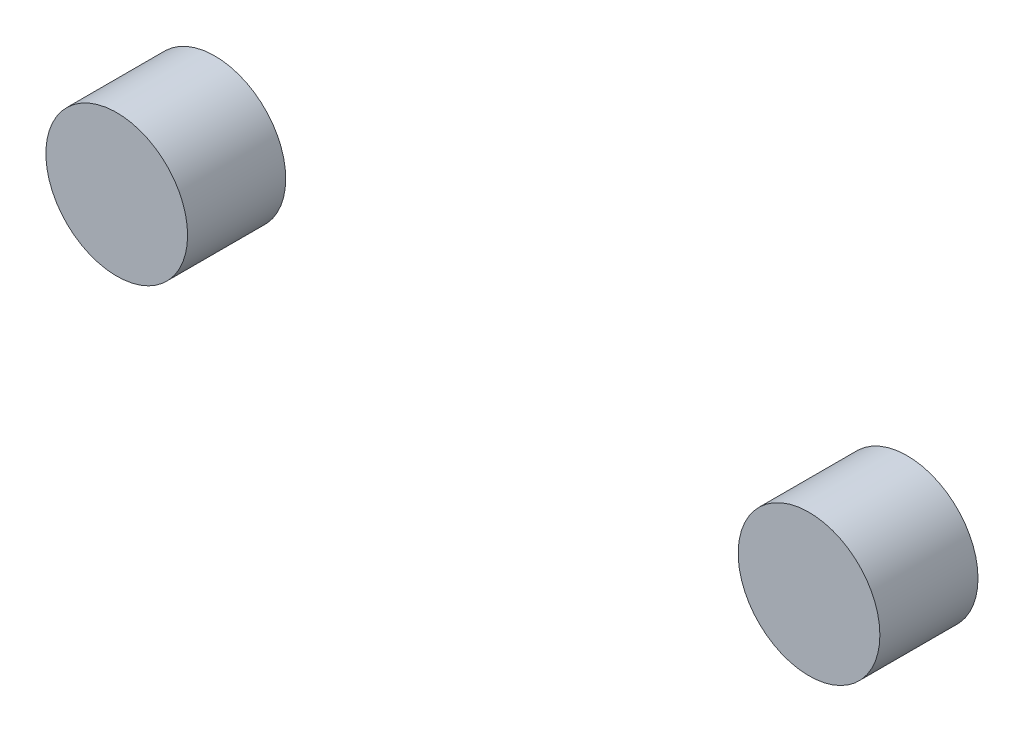
ISO-10303-21;
HEADER;
FILE_DESCRIPTION(('STEP AP214'),'2;1');
FILE_NAME('part.step','',(''),(''),'','','');
FILE_SCHEMA(('AUTOMOTIVE_DESIGN { 1 0 10303 214 1 1 1 1 }'));
ENDSEC;
DATA;
#1=APPLICATION_CONTEXT('core data for automotive mechanical design processes');
#2=APPLICATION_PROTOCOL_DEFINITION('international standard','automotive_design',2000,#1);
#3=PRODUCT_CONTEXT('',#1,'mechanical');
#4=PRODUCT('Part','Part','',(#3));
#5=PRODUCT_RELATED_PRODUCT_CATEGORY('part','',(#4));
#6=PRODUCT_DEFINITION_FORMATION('','',#4);
#7=PRODUCT_DEFINITION_CONTEXT('part definition',#1,'design');
#8=PRODUCT_DEFINITION('design','',#6,#7);
#9=PRODUCT_DEFINITION_SHAPE('','',#8);
#10=(LENGTH_UNIT() NAMED_UNIT(*) SI_UNIT(.MILLI.,.METRE.));
#11=(NAMED_UNIT(*) PLANE_ANGLE_UNIT() SI_UNIT($,.RADIAN.));
#12=(NAMED_UNIT(*) SI_UNIT($,.STERADIAN.) SOLID_ANGLE_UNIT());
#13=UNCERTAINTY_MEASURE_WITH_UNIT(LENGTH_MEASURE(1.E-05),#10,'distance_accuracy_value','');
#14=(GEOMETRIC_REPRESENTATION_CONTEXT(3) GLOBAL_UNCERTAINTY_ASSIGNED_CONTEXT((#13)) GLOBAL_UNIT_ASSIGNED_CONTEXT((#10,
#11,#12)) REPRESENTATION_CONTEXT('',''));
#15=CARTESIAN_POINT('',(0.,0.,0.));
#16=DIRECTION('',(0.,0.,1.));
#17=DIRECTION('',(1.,0.,0.));
#18=AXIS2_PLACEMENT_3D('',#15,#16,#17);
#19=CARTESIAN_POINT('',(1.275,-15.24,-1.7));
#20=DIRECTION('',(0.,0.,1.));
#21=DIRECTION('',(1.,0.,0.));
#22=AXIS2_PLACEMENT_3D('',#19,#20,#21);
#23=PLANE('',#22);
#24=CARTESIAN_POINT('',(1.275,-15.24,-1.7));
#25=DIRECTION('',(0.,0.,1.));
#26=DIRECTION('',(1.,0.,0.));
#27=AXIS2_PLACEMENT_3D('',#24,#25,#26);
#28=CIRCLE('',#27,1.3);
#29=CARTESIAN_POINT('',(2.575,-15.24,-1.7));
#30=VERTEX_POINT('',#29);
#31=EDGE_CURVE('P0_E11',#30,#30,#28,.T.);
#32=ORIENTED_EDGE('',*,*,#31,.F.);
#33=EDGE_LOOP('',(#32));
#34=FACE_BOUND('',#33,.T.);
#35=ADVANCED_FACE('P0_F16',(#34),#23,.F.);
#36=CARTESIAN_POINT('',(1.275,-15.24,0.1));
#37=DIRECTION('',(0.,0.,1.));
#38=DIRECTION('',(1.,0.,0.));
#39=AXIS2_PLACEMENT_3D('',#36,#37,#38);
#40=PLANE('',#39);
#41=CARTESIAN_POINT('',(1.275,-15.24,0.1));
#42=DIRECTION('',(0.,0.,1.));
#43=DIRECTION('',(1.,0.,0.));
#44=AXIS2_PLACEMENT_3D('',#41,#42,#43);
#45=CIRCLE('',#44,1.3);
#46=CARTESIAN_POINT('',(2.575,-15.24,0.1));
#47=VERTEX_POINT('',#46);
#48=EDGE_CURVE('P0_E20',#47,#47,#45,.T.);
#49=ORIENTED_EDGE('',*,*,#48,.T.);
#50=EDGE_LOOP('',(#49));
#51=FACE_BOUND('',#50,.T.);
#52=ADVANCED_FACE('P0_F18',(#51),#40,.T.);
#53=CARTESIAN_POINT('',(1.275,-15.24,-1.7));
#54=DIRECTION('',(0.,0.,1.));
#55=DIRECTION('',(1.,0.,0.));
#56=AXIS2_PLACEMENT_3D('',#53,#54,#55);
#57=CYLINDRICAL_SURFACE('',#56,1.3);
#58=ORIENTED_EDGE('',*,*,#48,.F.);
#59=DIRECTION('',(0.,0.,1.));
#60=VECTOR('',#59,1.);
#61=CARTESIAN_POINT('',(2.575,-15.24,-1.7));
#62=LINE('',#61,#60);
#63=EDGE_CURVE('P0_E27',#30,#47,#62,.T.);
#64=ORIENTED_EDGE('',*,*,#63,.F.);
#65=ORIENTED_EDGE('',*,*,#31,.T.);
#66=ORIENTED_EDGE('',*,*,#63,.T.);
#67=EDGE_LOOP('',(#58,#64,#65,#66));
#68=FACE_BOUND('',#67,.T.);
#69=ADVANCED_FACE('P0_F42',(#68),#57,.T.);
#70=CLOSED_SHELL('',(#35,#52,#69));
#71=MANIFOLD_SOLID_BREP('P0_B1',#70);
#72=CARTESIAN_POINT('',(-11.425,-15.24,-1.7));
#73=DIRECTION('',(0.,0.,1.));
#74=DIRECTION('',(1.,0.,0.));
#75=AXIS2_PLACEMENT_3D('',#72,#73,#74);
#76=PLANE('',#75);
#77=CARTESIAN_POINT('',(-11.425,-15.24,-1.7));
#78=DIRECTION('',(0.,0.,1.));
#79=DIRECTION('',(1.,0.,0.));
#80=AXIS2_PLACEMENT_3D('',#77,#78,#79);
#81=CIRCLE('',#80,1.3);
#82=CARTESIAN_POINT('',(-10.125,-15.24,-1.7));
#83=VERTEX_POINT('',#82);
#84=EDGE_CURVE('P1_E11',#83,#83,#81,.T.);
#85=ORIENTED_EDGE('',*,*,#84,.F.);
#86=EDGE_LOOP('',(#85));
#87=FACE_BOUND('',#86,.T.);
#88=ADVANCED_FACE('P1_F16',(#87),#76,.F.);
#89=CARTESIAN_POINT('',(-11.425,-15.24,0.1));
#90=DIRECTION('',(0.,0.,1.));
#91=DIRECTION('',(1.,0.,0.));
#92=AXIS2_PLACEMENT_3D('',#89,#90,#91);
#93=PLANE('',#92);
#94=CARTESIAN_POINT('',(-11.425,-15.24,0.1));
#95=DIRECTION('',(0.,0.,1.));
#96=DIRECTION('',(1.,0.,0.));
#97=AXIS2_PLACEMENT_3D('',#94,#95,#96);
#98=CIRCLE('',#97,1.3);
#99=CARTESIAN_POINT('',(-10.125,-15.24,0.1));
#100=VERTEX_POINT('',#99);
#101=EDGE_CURVE('P1_E19',#100,#100,#98,.T.);
#102=ORIENTED_EDGE('',*,*,#101,.T.);
#103=EDGE_LOOP('',(#102));
#104=FACE_BOUND('',#103,.T.);
#105=ADVANCED_FACE('P1_F44',(#104),#93,.T.);
#106=CARTESIAN_POINT('',(-11.425,-15.24,-1.7));
#107=DIRECTION('',(0.,0.,1.));
#108=DIRECTION('',(1.,0.,0.));
#109=AXIS2_PLACEMENT_3D('',#106,#107,#108);
#110=CYLINDRICAL_SURFACE('',#109,1.3);
#111=ORIENTED_EDGE('',*,*,#101,.F.);
#112=DIRECTION('',(0.,0.,1.));
#113=VECTOR('',#112,1.);
#114=CARTESIAN_POINT('',(-10.125,-15.24,-1.7));
#115=LINE('',#114,#113);
#116=EDGE_CURVE('P1_E25',#83,#100,#115,.T.);
#117=ORIENTED_EDGE('',*,*,#116,.F.);
#118=ORIENTED_EDGE('',*,*,#84,.T.);
#119=ORIENTED_EDGE('',*,*,#116,.T.);
#120=EDGE_LOOP('',(#111,#117,#118,#119));
#121=FACE_BOUND('',#120,.T.);
#122=ADVANCED_FACE('P1_F40',(#121),#110,.T.);
#123=CLOSED_SHELL('',(#88,#105,#122));
#124=MANIFOLD_SOLID_BREP('P1_B1',#123);
#125=ADVANCED_BREP_SHAPE_REPRESENTATION('',(#18,#71,#124),#14);
#126=SHAPE_DEFINITION_REPRESENTATION(#9,#125);
ENDSEC;
END-ISO-10303-21;
